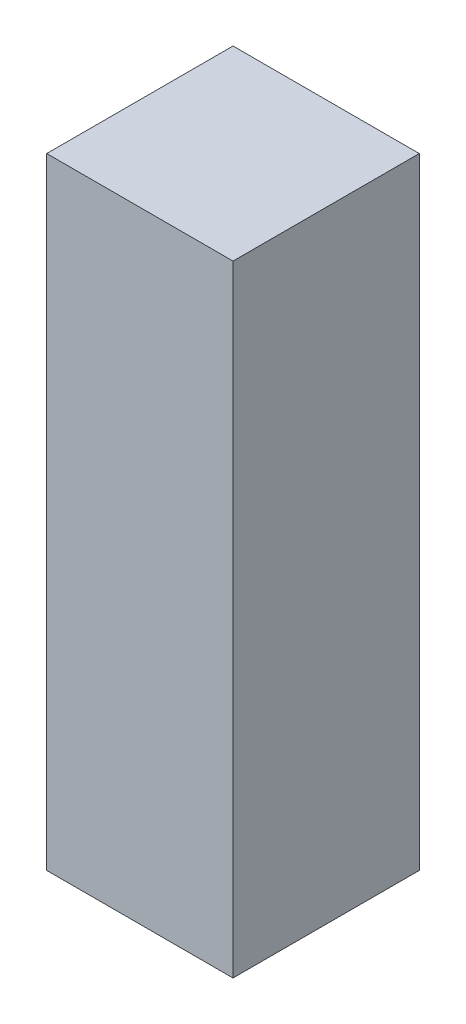
ISO-10303-21;
HEADER;
FILE_DESCRIPTION(('STEP AP214'),'2;1');
FILE_NAME('part.step','',(''),(''),'','','');
FILE_SCHEMA(('AUTOMOTIVE_DESIGN { 1 0 10303 214 1 1 1 1 }'));
ENDSEC;
DATA;
#1=APPLICATION_CONTEXT('core data for automotive mechanical design processes');
#2=APPLICATION_PROTOCOL_DEFINITION('international standard','automotive_design',2000,#1);
#3=PRODUCT_CONTEXT('',#1,'mechanical');
#4=PRODUCT('Part','Part','',(#3));
#5=PRODUCT_RELATED_PRODUCT_CATEGORY('part','',(#4));
#6=PRODUCT_DEFINITION_FORMATION('','',#4);
#7=PRODUCT_DEFINITION_CONTEXT('part definition',#1,'design');
#8=PRODUCT_DEFINITION('design','',#6,#7);
#9=PRODUCT_DEFINITION_SHAPE('','',#8);
#10=(LENGTH_UNIT() NAMED_UNIT(*) SI_UNIT(.MILLI.,.METRE.));
#11=(NAMED_UNIT(*) PLANE_ANGLE_UNIT() SI_UNIT($,.RADIAN.));
#12=(NAMED_UNIT(*) SI_UNIT($,.STERADIAN.) SOLID_ANGLE_UNIT());
#13=UNCERTAINTY_MEASURE_WITH_UNIT(LENGTH_MEASURE(1.E-05),#10,'distance_accuracy_value','');
#14=(GEOMETRIC_REPRESENTATION_CONTEXT(3) GLOBAL_UNCERTAINTY_ASSIGNED_CONTEXT((#13)) GLOBAL_UNIT_ASSIGNED_CONTEXT((#10,
#11,#12)) REPRESENTATION_CONTEXT('',''));
#15=CARTESIAN_POINT('',(0.,0.,0.));
#16=DIRECTION('',(0.,0.,1.));
#17=DIRECTION('',(1.,0.,0.));
#18=AXIS2_PLACEMENT_3D('',#15,#16,#17);
#19=CARTESIAN_POINT('',(0.,10.,0.));
#20=DIRECTION('',(1.,0.,0.));
#21=DIRECTION('',(0.,0.,-1.));
#22=AXIS2_PLACEMENT_3D('',#19,#20,#21);
#23=PLANE('',#22);
#24=DIRECTION('',(0.,0.,1.));
#25=VECTOR('',#24,1.);
#26=CARTESIAN_POINT('',(0.,0.,0.));
#27=LINE('',#26,#25);
#28=CARTESIAN_POINT('',(0.,0.,-3.));
#29=VERTEX_POINT('',#28);
#30=CARTESIAN_POINT('',(0.,0.,0.));
#31=VERTEX_POINT('',#30);
#32=EDGE_CURVE('E117',#29,#31,#27,.T.);
#33=ORIENTED_EDGE('',*,*,#32,.T.);
#34=DIRECTION('',(0.,-1.,0.));
#35=VECTOR('',#34,1.);
#36=CARTESIAN_POINT('',(0.,10.,0.));
#37=LINE('',#36,#35);
#38=CARTESIAN_POINT('',(0.,10.,0.));
#39=VERTEX_POINT('',#38);
#40=EDGE_CURVE('E11',#39,#31,#37,.T.);
#41=ORIENTED_EDGE('',*,*,#40,.F.);
#42=DIRECTION('',(0.,0.,1.));
#43=VECTOR('',#42,1.);
#44=CARTESIAN_POINT('',(0.,10.,0.));
#45=LINE('',#44,#43);
#46=CARTESIAN_POINT('',(0.,10.,-3.));
#47=VERTEX_POINT('',#46);
#48=EDGE_CURVE('E101',#47,#39,#45,.T.);
#49=ORIENTED_EDGE('',*,*,#48,.F.);
#50=DIRECTION('',(0.,-1.,0.));
#51=VECTOR('',#50,1.);
#52=CARTESIAN_POINT('',(0.,10.,-3.));
#53=LINE('',#52,#51);
#54=EDGE_CURVE('E113',#47,#29,#53,.T.);
#55=ORIENTED_EDGE('',*,*,#54,.T.);
#56=EDGE_LOOP('',(#33,#41,#49,#55));
#57=FACE_BOUND('',#56,.T.);
#58=ADVANCED_FACE('F49',(#57),#23,.F.);
#59=CARTESIAN_POINT('',(0.,10.,0.));
#60=DIRECTION('',(0.,0.,-1.));
#61=DIRECTION('',(-1.,0.,0.));
#62=AXIS2_PLACEMENT_3D('',#59,#60,#61);
#63=PLANE('',#62);
#64=DIRECTION('',(1.,0.,0.));
#65=VECTOR('',#64,1.);
#66=CARTESIAN_POINT('',(0.,0.,0.));
#67=LINE('',#66,#65);
#68=CARTESIAN_POINT('',(3.,0.,0.));
#69=VERTEX_POINT('',#68);
#70=EDGE_CURVE('E106',#31,#69,#67,.T.);
#71=ORIENTED_EDGE('',*,*,#70,.T.);
#72=DIRECTION('',(0.,-1.,0.));
#73=VECTOR('',#72,1.);
#74=CARTESIAN_POINT('',(3.,10.,0.));
#75=LINE('',#74,#73);
#76=CARTESIAN_POINT('',(3.,10.,0.));
#77=VERTEX_POINT('',#76);
#78=EDGE_CURVE('E58',#77,#69,#75,.T.);
#79=ORIENTED_EDGE('',*,*,#78,.F.);
#80=DIRECTION('',(1.,0.,0.));
#81=VECTOR('',#80,1.);
#82=CARTESIAN_POINT('',(0.,10.,0.));
#83=LINE('',#82,#81);
#84=EDGE_CURVE('E96',#39,#77,#83,.T.);
#85=ORIENTED_EDGE('',*,*,#84,.F.);
#86=ORIENTED_EDGE('',*,*,#40,.T.);
#87=EDGE_LOOP('',(#71,#79,#85,#86));
#88=FACE_BOUND('',#87,.T.);
#89=ADVANCED_FACE('F105',(#88),#63,.F.);
#90=CARTESIAN_POINT('',(3.,10.,0.));
#91=DIRECTION('',(-1.,0.,0.));
#92=DIRECTION('',(0.,0.,1.));
#93=AXIS2_PLACEMENT_3D('',#90,#91,#92);
#94=PLANE('',#93);
#95=DIRECTION('',(0.,0.,-1.));
#96=VECTOR('',#95,1.);
#97=CARTESIAN_POINT('',(3.,0.,0.));
#98=LINE('',#97,#96);
#99=CARTESIAN_POINT('',(3.,0.,-3.));
#100=VERTEX_POINT('',#99);
#101=EDGE_CURVE('E83',#69,#100,#98,.T.);
#102=ORIENTED_EDGE('',*,*,#101,.T.);
#103=DIRECTION('',(0.,-1.,0.));
#104=VECTOR('',#103,1.);
#105=CARTESIAN_POINT('',(3.,10.,-3.));
#106=LINE('',#105,#104);
#107=CARTESIAN_POINT('',(3.,10.,-3.));
#108=VERTEX_POINT('',#107);
#109=EDGE_CURVE('E108',#108,#100,#106,.T.);
#110=ORIENTED_EDGE('',*,*,#109,.F.);
#111=DIRECTION('',(0.,0.,-1.));
#112=VECTOR('',#111,1.);
#113=CARTESIAN_POINT('',(3.,10.,0.));
#114=LINE('',#113,#112);
#115=EDGE_CURVE('E99',#77,#108,#114,.T.);
#116=ORIENTED_EDGE('',*,*,#115,.F.);
#117=ORIENTED_EDGE('',*,*,#78,.T.);
#118=EDGE_LOOP('',(#102,#110,#116,#117));
#119=FACE_BOUND('',#118,.T.);
#120=ADVANCED_FACE('F109',(#119),#94,.F.);
#121=CARTESIAN_POINT('',(0.,10.,-3.));
#122=DIRECTION('',(0.,0.,1.));
#123=DIRECTION('',(1.,0.,0.));
#124=AXIS2_PLACEMENT_3D('',#121,#122,#123);
#125=PLANE('',#124);
#126=DIRECTION('',(-1.,0.,0.));
#127=VECTOR('',#126,1.);
#128=CARTESIAN_POINT('',(0.,0.,-3.));
#129=LINE('',#128,#127);
#130=EDGE_CURVE('E89',#100,#29,#129,.T.);
#131=ORIENTED_EDGE('',*,*,#130,.T.);
#132=ORIENTED_EDGE('',*,*,#54,.F.);
#133=DIRECTION('',(-1.,0.,0.));
#134=VECTOR('',#133,1.);
#135=CARTESIAN_POINT('',(0.,10.,-3.));
#136=LINE('',#135,#134);
#137=EDGE_CURVE('E66',#108,#47,#136,.T.);
#138=ORIENTED_EDGE('',*,*,#137,.F.);
#139=ORIENTED_EDGE('',*,*,#109,.T.);
#140=EDGE_LOOP('',(#131,#132,#138,#139));
#141=FACE_BOUND('',#140,.T.);
#142=ADVANCED_FACE('F130',(#141),#125,.F.);
#143=CARTESIAN_POINT('',(0.,10.,0.));
#144=DIRECTION('',(0.,-1.,0.));
#145=DIRECTION('',(0.,0.,-1.));
#146=AXIS2_PLACEMENT_3D('',#143,#144,#145);
#147=PLANE('',#146);
#148=ORIENTED_EDGE('',*,*,#48,.T.);
#149=ORIENTED_EDGE('',*,*,#84,.T.);
#150=ORIENTED_EDGE('',*,*,#115,.T.);
#151=ORIENTED_EDGE('',*,*,#137,.T.);
#152=EDGE_LOOP('',(#148,#149,#150,#151));
#153=FACE_BOUND('',#152,.T.);
#154=ADVANCED_FACE('F97',(#153),#147,.F.);
#155=CARTESIAN_POINT('',(0.,0.,0.));
#156=DIRECTION('',(0.,-1.,0.));
#157=DIRECTION('',(0.,0.,-1.));
#158=AXIS2_PLACEMENT_3D('',#155,#156,#157);
#159=PLANE('',#158);
#160=ORIENTED_EDGE('',*,*,#32,.F.);
#161=ORIENTED_EDGE('',*,*,#130,.F.);
#162=ORIENTED_EDGE('',*,*,#101,.F.);
#163=ORIENTED_EDGE('',*,*,#70,.F.);
#164=EDGE_LOOP('',(#160,#161,#162,#163));
#165=FACE_BOUND('',#164,.T.);
#166=ADVANCED_FACE('F133',(#165),#159,.T.);
#167=CLOSED_SHELL('',(#58,#89,#120,#142,#154,#166));
#168=MANIFOLD_SOLID_BREP('B2',#167);
#169=ADVANCED_BREP_SHAPE_REPRESENTATION('',(#18,#168),#14);
#170=SHAPE_DEFINITION_REPRESENTATION(#9,#169);
ENDSEC;
END-ISO-10303-21;
